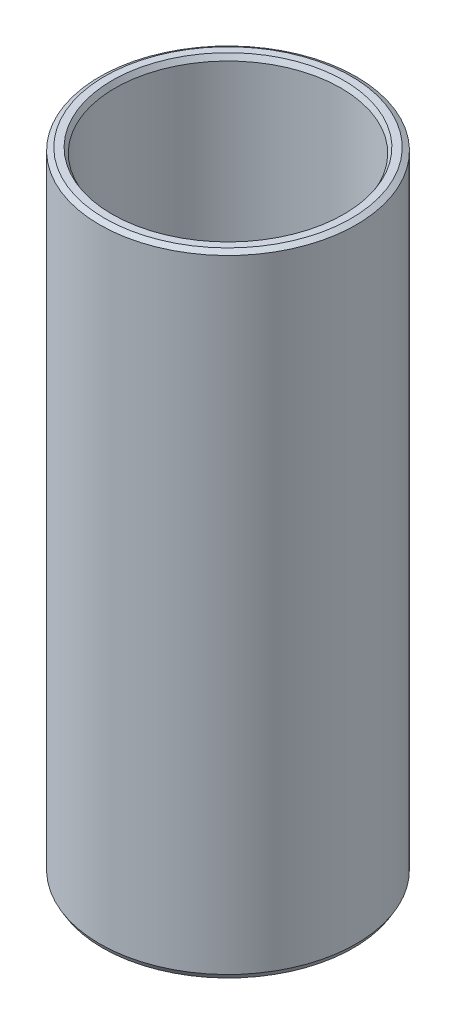
ISO-10303-21;
HEADER;
FILE_DESCRIPTION(('STEP AP214'),'2;1');
FILE_NAME('part.step','',(''),(''),'','','');
FILE_SCHEMA(('AUTOMOTIVE_DESIGN { 1 0 10303 214 1 1 1 1 }'));
ENDSEC;
DATA;
#1=APPLICATION_CONTEXT('core data for automotive mechanical design processes');
#2=APPLICATION_PROTOCOL_DEFINITION('international standard','automotive_design',2000,#1);
#3=PRODUCT_CONTEXT('',#1,'mechanical');
#4=PRODUCT('Part','Part','',(#3));
#5=PRODUCT_RELATED_PRODUCT_CATEGORY('part','',(#4));
#6=PRODUCT_DEFINITION_FORMATION('','',#4);
#7=PRODUCT_DEFINITION_CONTEXT('part definition',#1,'design');
#8=PRODUCT_DEFINITION('design','',#6,#7);
#9=PRODUCT_DEFINITION_SHAPE('','',#8);
#10=(LENGTH_UNIT() NAMED_UNIT(*) SI_UNIT(.MILLI.,.METRE.));
#11=(NAMED_UNIT(*) PLANE_ANGLE_UNIT() SI_UNIT($,.RADIAN.));
#12=(NAMED_UNIT(*) SI_UNIT($,.STERADIAN.) SOLID_ANGLE_UNIT());
#13=UNCERTAINTY_MEASURE_WITH_UNIT(LENGTH_MEASURE(1.E-05),#10,'distance_accuracy_value','');
#14=(GEOMETRIC_REPRESENTATION_CONTEXT(3) GLOBAL_UNCERTAINTY_ASSIGNED_CONTEXT((#13)) GLOBAL_UNIT_ASSIGNED_CONTEXT((#10,
#11,#12)) REPRESENTATION_CONTEXT('',''));
#15=CARTESIAN_POINT('',(0.,0.,0.));
#16=DIRECTION('',(0.,0.,1.));
#17=DIRECTION('',(1.,0.,0.));
#18=AXIS2_PLACEMENT_3D('',#15,#16,#17);
#19=CARTESIAN_POINT('',(0.,233.491166792557,0.));
#20=DIRECTION('',(0.,-1.,0.));
#21=DIRECTION('',(0.,0.,-1.));
#22=AXIS2_PLACEMENT_3D('',#19,#20,#21);
#23=CYLINDRICAL_SURFACE('',#22,47.5);
#24=CARTESIAN_POINT('',(0.,1.8945185427387,0.));
#25=DIRECTION('',(0.,1.,0.));
#26=DIRECTION('',(0.,0.,1.));
#27=AXIS2_PLACEMENT_3D('',#24,#25,#26);
#28=CIRCLE('',#27,47.5);
#29=CARTESIAN_POINT('',(0.,1.8945185427387,47.5));
#30=VERTEX_POINT('',#29);
#31=EDGE_CURVE('E10',#30,#30,#28,.T.);
#32=ORIENTED_EDGE('',*,*,#31,.T.);
#33=EDGE_LOOP('',(#32));
#34=FACE_BOUND('',#33,.T.);
#35=CARTESIAN_POINT('',(0.,232.397366001922,0.));
#36=DIRECTION('',(0.,1.,0.));
#37=DIRECTION('',(0.,0.,1.));
#38=AXIS2_PLACEMENT_3D('',#35,#36,#37);
#39=CIRCLE('',#38,47.5);
#40=CARTESIAN_POINT('',(0.,232.397366001922,47.5));
#41=VERTEX_POINT('',#40);
#42=EDGE_CURVE('E50',#41,#41,#39,.F.);
#43=ORIENTED_EDGE('',*,*,#42,.T.);
#44=EDGE_LOOP('',(#43));
#45=FACE_BOUND('',#44,.T.);
#46=ADVANCED_FACE('F39',(#34,#45),#23,.T.);
#47=CARTESIAN_POINT('',(0.,233.491166792557,0.));
#48=DIRECTION('',(0.,1.,0.));
#49=DIRECTION('',(0.,0.,1.));
#50=AXIS2_PLACEMENT_3D('',#47,#48,#49);
#51=PLANE('',#50);
#52=CARTESIAN_POINT('',(0.,233.491166792557,0.));
#53=DIRECTION('',(0.,1.,0.));
#54=DIRECTION('',(0.,0.,1.));
#55=AXIS2_PLACEMENT_3D('',#52,#53,#54);
#56=CIRCLE('',#55,42.9102475582358);
#57=CARTESIAN_POINT('',(0.,233.491166792557,42.9102475582358));
#58=VERTEX_POINT('',#57);
#59=EDGE_CURVE('E58',#58,#58,#56,.F.);
#60=ORIENTED_EDGE('',*,*,#59,.T.);
#61=EDGE_LOOP('',(#60));
#62=FACE_BOUND('',#61,.T.);
#63=CARTESIAN_POINT('',(0.,233.491166792557,0.));
#64=DIRECTION('',(0.,1.,0.));
#65=DIRECTION('',(0.,0.,1.));
#66=AXIS2_PLACEMENT_3D('',#63,#64,#65);
#67=CIRCLE('',#66,45.6054814572612);
#68=CARTESIAN_POINT('',(0.,233.491166792557,45.6054814572612));
#69=VERTEX_POINT('',#68);
#70=EDGE_CURVE('E61',#69,#69,#67,.T.);
#71=ORIENTED_EDGE('',*,*,#70,.T.);
#72=EDGE_LOOP('',(#71));
#73=FACE_BOUND('',#72,.T.);
#74=ADVANCED_FACE('F88',(#62,#73),#51,.T.);
#75=CARTESIAN_POINT('',(0.,0.,0.));
#76=DIRECTION('',(0.,1.,0.));
#77=DIRECTION('',(0.,0.,1.));
#78=AXIS2_PLACEMENT_3D('',#75,#76,#77);
#79=PLANE('',#78);
#80=CARTESIAN_POINT('',(0.,0.,0.));
#81=DIRECTION('',(0.,1.,0.));
#82=DIRECTION('',(0.,0.,1.));
#83=AXIS2_PLACEMENT_3D('',#80,#81,#82);
#84=CIRCLE('',#83,43.7109653103395);
#85=CARTESIAN_POINT('',(0.,0.,43.7109653103395));
#86=VERTEX_POINT('',#85);
#87=EDGE_CURVE('E51',#86,#86,#84,.T.);
#88=ORIENTED_EDGE('',*,*,#87,.T.);
#89=EDGE_LOOP('',(#88));
#90=FACE_BOUND('',#89,.T.);
#91=CARTESIAN_POINT('',(0.,0.,0.));
#92=DIRECTION('',(0.,1.,0.));
#93=DIRECTION('',(0.,0.,1.));
#94=AXIS2_PLACEMENT_3D('',#91,#92,#93);
#95=CIRCLE('',#94,46.406199209365);
#96=CARTESIAN_POINT('',(0.,0.,46.406199209365));
#97=VERTEX_POINT('',#96);
#98=EDGE_CURVE('E54',#97,#97,#95,.F.);
#99=ORIENTED_EDGE('',*,*,#98,.T.);
#100=EDGE_LOOP('',(#99));
#101=FACE_BOUND('',#100,.T.);
#102=ADVANCED_FACE('F83',(#90,#101),#79,.F.);
#103=CARTESIAN_POINT('',(0.,233.491166792557,0.));
#104=DIRECTION('',(0.,-1.,0.));
#105=DIRECTION('',(0.,0.,-1.));
#106=AXIS2_PLACEMENT_3D('',#103,#104,#105);
#107=CYLINDRICAL_SURFACE('',#106,41.8164467676008);
#108=CARTESIAN_POINT('',(0.,231.596648249818,0.));
#109=DIRECTION('',(0.,1.,0.));
#110=DIRECTION('',(0.,0.,1.));
#111=AXIS2_PLACEMENT_3D('',#108,#109,#110);
#112=CIRCLE('',#111,41.8164467676008);
#113=CARTESIAN_POINT('',(0.,231.596648249818,41.8164467676008));
#114=VERTEX_POINT('',#113);
#115=EDGE_CURVE('E67',#114,#114,#112,.T.);
#116=ORIENTED_EDGE('',*,*,#115,.T.);
#117=EDGE_LOOP('',(#116));
#118=FACE_BOUND('',#117,.T.);
#119=CARTESIAN_POINT('',(0.,1.09380079063498,0.));
#120=DIRECTION('',(0.,1.,0.));
#121=DIRECTION('',(0.,0.,1.));
#122=AXIS2_PLACEMENT_3D('',#119,#120,#121);
#123=CIRCLE('',#122,41.8164467676008);
#124=CARTESIAN_POINT('',(0.,1.09380079063498,41.8164467676008));
#125=VERTEX_POINT('',#124);
#126=EDGE_CURVE('E69',#125,#125,#123,.F.);
#127=ORIENTED_EDGE('',*,*,#126,.T.);
#128=EDGE_LOOP('',(#127));
#129=FACE_BOUND('',#128,.T.);
#130=ADVANCED_FACE('F71',(#118,#129),#107,.F.);
#131=CARTESIAN_POINT('',(0.,231.596648249818,0.));
#132=DIRECTION('',(0.,1.,0.));
#133=DIRECTION('',(0.,0.,1.));
#134=AXIS2_PLACEMENT_3D('',#131,#132,#133);
#135=CONICAL_SURFACE('',#134,41.8164467676008,0.523598775598293);
#136=CARTESIAN_POINT('',(0.,233.491166792557,42.9102475582358));
#137=CARTESIAN_POINT('',(0.,233.471432224404,42.8988538));
#138=CARTESIAN_POINT('',(0.,233.45169765625,42.8874600417642));
#139=CARTESIAN_POINT('',(0.,233.412228519943,42.8646725252926));
#140=CARTESIAN_POINT('',(0.,233.392493951789,42.8532787670569));
#141=CARTESIAN_POINT('',(0.,233.353024815482,42.8304912505853));
#142=CARTESIAN_POINT('',(0.,233.333290247329,42.8190974923495));
#143=CARTESIAN_POINT('',(0.,233.293821111022,42.796309975878));
#144=CARTESIAN_POINT('',(0.,233.274086542868,42.7849162176422));
#145=CARTESIAN_POINT('',(0.,233.234617406561,42.7621287011706));
#146=CARTESIAN_POINT('',(0.,233.214882838408,42.7507349429348));
#147=CARTESIAN_POINT('',(0.,233.175413702101,42.7279474264633));
#148=CARTESIAN_POINT('',(0.,233.155679133947,42.7165536682275));
#149=CARTESIAN_POINT('',(0.,233.11620999764,42.6937661517559));
#150=CARTESIAN_POINT('',(0.,233.096475429486,42.6823723935201));
#151=CARTESIAN_POINT('',(0.,233.057006293179,42.6595848770486));
#152=CARTESIAN_POINT('',(0.,233.037271725026,42.6481911188128));
#153=CARTESIAN_POINT('',(0.,232.997802588719,42.6254036023412));
#154=CARTESIAN_POINT('',(0.,232.978068020565,42.6140098441054));
#155=CARTESIAN_POINT('',(0.,232.938598884258,42.5912223276339));
#156=CARTESIAN_POINT('',(0.,232.918864316105,42.5798285693981));
#157=CARTESIAN_POINT('',(0.,232.879395179798,42.5570410529266));
#158=CARTESIAN_POINT('',(0.,232.859660611644,42.5456472946908));
#159=CARTESIAN_POINT('',(0.,232.820191475337,42.5228597782192));
#160=CARTESIAN_POINT('',(0.,232.800456907183,42.5114660199834));
#161=CARTESIAN_POINT('',(0.,232.760987770876,42.4886785035118));
#162=CARTESIAN_POINT('',(0.,232.741253202723,42.4772847452761));
#163=CARTESIAN_POINT('',(0.,232.701784066416,42.4544972288045));
#164=CARTESIAN_POINT('',(0.,232.682049498262,42.4431034705687));
#165=CARTESIAN_POINT('',(0.,232.642580361955,42.4203159540972));
#166=CARTESIAN_POINT('',(0.,232.622845793802,42.4089221958614));
#167=CARTESIAN_POINT('',(0.,232.583376657495,42.3861346793898));
#168=CARTESIAN_POINT('',(0.,232.563642089341,42.374740921154));
#169=CARTESIAN_POINT('',(0.,232.524172953034,42.3519534046825));
#170=CARTESIAN_POINT('',(0.,232.504438384881,42.3405596464467));
#171=CARTESIAN_POINT('',(0.,232.464969248573,42.3177721299751));
#172=CARTESIAN_POINT('',(0.,232.44523468042,42.3063783717394));
#173=CARTESIAN_POINT('',(0.,232.405765544113,42.2835908552678));
#174=CARTESIAN_POINT('',(0.,232.386030975959,42.272197097032));
#175=CARTESIAN_POINT('',(0.,232.346561839652,42.2494095805604));
#176=CARTESIAN_POINT('',(0.,232.326827271499,42.2380158223247));
#177=CARTESIAN_POINT('',(0.,232.287358135192,42.2152283058531));
#178=CARTESIAN_POINT('',(0.,232.267623567038,42.2038345476173));
#179=CARTESIAN_POINT('',(0.,232.228154430731,42.1810470311458));
#180=CARTESIAN_POINT('',(0.,232.208419862578,42.16965327291));
#181=CARTESIAN_POINT('',(0.,232.168950726271,42.1468657564384));
#182=CARTESIAN_POINT('',(0.,232.149216158117,42.1354719982026));
#183=CARTESIAN_POINT('',(0.,232.10974702181,42.1126844817311));
#184=CARTESIAN_POINT('',(0.,232.090012453656,42.1012907234953));
#185=CARTESIAN_POINT('',(0.,232.050543317349,42.0785032070237));
#186=CARTESIAN_POINT('',(0.,232.030808749196,42.0671094487879));
#187=CARTESIAN_POINT('',(0.,231.991339612889,42.0443219323164));
#188=CARTESIAN_POINT('',(0.,231.971605044735,42.0329281740806));
#189=CARTESIAN_POINT('',(0.,231.932135908428,42.010140657609));
#190=CARTESIAN_POINT('',(0.,231.912401340275,41.9987468993733));
#191=CARTESIAN_POINT('',(0.,231.872932203968,41.9759593829017));
#192=CARTESIAN_POINT('',(0.,231.853197635814,41.9645656246659));
#193=CARTESIAN_POINT('',(0.,231.813728499507,41.9417781081943));
#194=CARTESIAN_POINT('',(0.,231.793993931353,41.9303843499586));
#195=CARTESIAN_POINT('',(0.,231.754524795046,41.907596833487));
#196=CARTESIAN_POINT('',(0.,231.734790226893,41.8962030752512));
#197=CARTESIAN_POINT('',(0.,231.695321090586,41.8734155587797));
#198=CARTESIAN_POINT('',(0.,231.675586522432,41.8620218005439));
#199=CARTESIAN_POINT('',(0.,231.636117386125,41.8392342840723));
#200=CARTESIAN_POINT('',(0.,231.616382817972,41.8278405258365));
#201=CARTESIAN_POINT('',(0.,231.596648249818,41.8164467676008));
#202=B_SPLINE_CURVE_WITH_KNOTS('',3,(#136,#137,#138,#139,#140,#141,#142,#143,#144,#145,#146,
#147,#148,#149,#150,#151,#152,#153,#154,#155,#156,#157,#158,#159,#160,#161,#162,#163,#164,#165,
#166,#167,#168,#169,#170,#171,#172,#173,#174,#175,#176,#177,#178,#179,#180,#181,#182,#183,#184,
#185,#186,#187,#188,#189,#190,#191,#192,#193,#194,#195,#196,#197,#198,#199,#200,#201),
.UNSPECIFIED.,.F.,.F.,(4,2,2,2,2,2,2,2,2,2,2,2,2,2,2,2,2,2,2,2,2,2,2,2,2,2,2,2,2,2,2,2,4),(0.,
0.0683625494146833,0.136725098829363,0.205087648244043,0.27345019765875,0.34181274707343,
0.41017529648811,0.478537845902817,0.546900395317497,0.61526294473218,0.683625494146884,
0.751988043561564,0.820350592976247,0.888713142390951,0.957075691805631,1.02543824122031,
1.09380079063502,1.1621633400497,1.23052588946438,1.29888843887906,1.36725098829377,
1.43561353770845,1.50397608712313,1.57233863653783,1.64070118595251,1.7090637353672,
1.7774262847819,1.84578883419658,1.91415138361126,1.98251393302597,2.05087648244065,
2.11923903185533,2.18760158127001),.UNSPECIFIED.);
#203=EDGE_CURVE('BSEAM77',#58,#114,#202,.T.);
#204=ORIENTED_EDGE('',*,*,#59,.F.);
#205=ORIENTED_EDGE('',*,*,#115,.F.);
#206=ORIENTED_EDGE('',*,*,#203,.T.);
#207=ORIENTED_EDGE('',*,*,#203,.F.);
#208=EDGE_LOOP('',(#204,#206,#205,#207));
#209=FACE_BOUND('',#208,.T.);
#210=ADVANCED_FACE('F77',(#209),#135,.F.);
#211=CARTESIAN_POINT('',(0.,0.,0.));
#212=DIRECTION('',(0.,-1.,0.));
#213=DIRECTION('',(0.,0.,-1.));
#214=AXIS2_PLACEMENT_3D('',#211,#212,#213);
#215=CONICAL_SURFACE('',#214,43.7109653103395,1.04719755119659);
#216=ORIENTED_EDGE('',*,*,#126,.F.);
#217=EDGE_LOOP('',(#216));
#218=FACE_BOUND('',#217,.T.);
#219=ORIENTED_EDGE('',*,*,#87,.F.);
#220=EDGE_LOOP('',(#219));
#221=FACE_BOUND('',#220,.T.);
#222=ADVANCED_FACE('F73',(#218,#221),#215,.F.);
#223=CARTESIAN_POINT('',(0.,1.8945185427387,0.));
#224=DIRECTION('',(0.,1.,0.));
#225=DIRECTION('',(0.,0.,1.));
#226=AXIS2_PLACEMENT_3D('',#223,#224,#225);
#227=CONICAL_SURFACE('',#226,47.5,0.523598775598312);
#228=ORIENTED_EDGE('',*,*,#98,.F.);
#229=EDGE_LOOP('',(#228));
#230=FACE_BOUND('',#229,.T.);
#231=ORIENTED_EDGE('',*,*,#31,.F.);
#232=EDGE_LOOP('',(#231));
#233=FACE_BOUND('',#232,.T.);
#234=ADVANCED_FACE('F76',(#230,#233),#227,.T.);
#235=CARTESIAN_POINT('',(0.,233.491166792557,0.));
#236=DIRECTION('',(0.,-1.,0.));
#237=DIRECTION('',(0.,0.,-1.));
#238=AXIS2_PLACEMENT_3D('',#235,#236,#237);
#239=CONICAL_SURFACE('',#238,45.6054814572612,1.04719755119659);
#240=ORIENTED_EDGE('',*,*,#42,.F.);
#241=EDGE_LOOP('',(#240));
#242=FACE_BOUND('',#241,.T.);
#243=ORIENTED_EDGE('',*,*,#70,.F.);
#244=EDGE_LOOP('',(#243));
#245=FACE_BOUND('',#244,.T.);
#246=ADVANCED_FACE('F45',(#242,#245),#239,.T.);
#247=CLOSED_SHELL('',(#46,#74,#102,#130,#210,#222,#234,#246));
#248=MANIFOLD_SOLID_BREP('B2',#247);
#249=ADVANCED_BREP_SHAPE_REPRESENTATION('',(#18,#248),#14);
#250=SHAPE_DEFINITION_REPRESENTATION(#9,#249);
ENDSEC;
END-ISO-10303-21;
